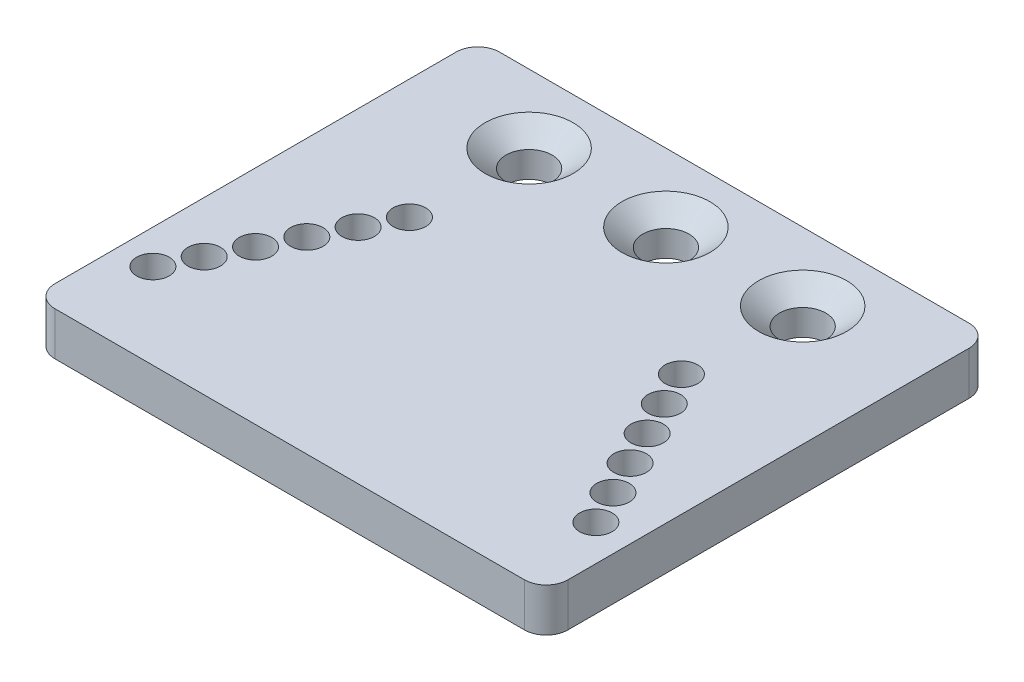
ISO-10303-21;
HEADER;
FILE_DESCRIPTION(('STEP AP214'),'2;1');
FILE_NAME('part.step','',(''),(''),'','','');
FILE_SCHEMA(('AUTOMOTIVE_DESIGN { 1 0 10303 214 1 1 1 1 }'));
ENDSEC;
DATA;
#1=APPLICATION_CONTEXT('core data for automotive mechanical design processes');
#2=APPLICATION_PROTOCOL_DEFINITION('international standard','automotive_design',2000,#1);
#3=PRODUCT_CONTEXT('',#1,'mechanical');
#4=PRODUCT('Part','Part','',(#3));
#5=PRODUCT_RELATED_PRODUCT_CATEGORY('part','',(#4));
#6=PRODUCT_DEFINITION_FORMATION('','',#4);
#7=PRODUCT_DEFINITION_CONTEXT('part definition',#1,'design');
#8=PRODUCT_DEFINITION('design','',#6,#7);
#9=PRODUCT_DEFINITION_SHAPE('','',#8);
#10=(LENGTH_UNIT() NAMED_UNIT(*) SI_UNIT(.MILLI.,.METRE.));
#11=(NAMED_UNIT(*) PLANE_ANGLE_UNIT() SI_UNIT($,.RADIAN.));
#12=(NAMED_UNIT(*) SI_UNIT($,.STERADIAN.) SOLID_ANGLE_UNIT());
#13=UNCERTAINTY_MEASURE_WITH_UNIT(LENGTH_MEASURE(1.E-05),#10,'distance_accuracy_value','');
#14=(GEOMETRIC_REPRESENTATION_CONTEXT(3) GLOBAL_UNCERTAINTY_ASSIGNED_CONTEXT((#13)) GLOBAL_UNIT_ASSIGNED_CONTEXT((#10,
#11,#12)) REPRESENTATION_CONTEXT('',''));
#15=CARTESIAN_POINT('',(0.,0.,0.));
#16=DIRECTION('',(0.,0.,1.));
#17=DIRECTION('',(1.,0.,0.));
#18=AXIS2_PLACEMENT_3D('',#15,#16,#17);
#19=CARTESIAN_POINT('',(71.825,6.35,-61.825));
#20=DIRECTION('',(0.,1.,0.));
#21=DIRECTION('',(0.,0.,1.));
#22=AXIS2_PLACEMENT_3D('',#19,#20,#21);
#23=PLANE('',#22);
#24=CARTESIAN_POINT('',(17.5,6.35,-55.));
#25=DIRECTION('',(0.,1.,0.));
#26=DIRECTION('',(0.,0.,1.));
#27=AXIS2_PLACEMENT_3D('',#24,#25,#26);
#28=CIRCLE('',#27,6.4389);
#29=CARTESIAN_POINT('',(17.5,6.35,-48.5611));
#30=VERTEX_POINT('',#29);
#31=EDGE_CURVE('E273',#30,#30,#28,.T.);
#32=ORIENTED_EDGE('',*,*,#31,.F.);
#33=EDGE_LOOP('',(#32));
#34=FACE_BOUND('',#33,.T.);
#35=CARTESIAN_POINT('',(57.5,6.35,-55.));
#36=DIRECTION('',(0.,1.,0.));
#37=DIRECTION('',(0.,0.,1.));
#38=AXIS2_PLACEMENT_3D('',#35,#36,#37);
#39=CIRCLE('',#38,6.4389);
#40=CARTESIAN_POINT('',(57.5,6.35,-48.5611));
#41=VERTEX_POINT('',#40);
#42=EDGE_CURVE('E264',#41,#41,#39,.T.);
#43=ORIENTED_EDGE('',*,*,#42,.F.);
#44=EDGE_LOOP('',(#43));
#45=FACE_BOUND('',#44,.T.);
#46=CARTESIAN_POINT('',(37.5,6.35,-55.));
#47=DIRECTION('',(0.,1.,0.));
#48=DIRECTION('',(0.,0.,1.));
#49=AXIS2_PLACEMENT_3D('',#46,#47,#48);
#50=CIRCLE('',#49,6.4389);
#51=CARTESIAN_POINT('',(37.5,6.35,-48.5611));
#52=VERTEX_POINT('',#51);
#53=EDGE_CURVE('E255',#52,#52,#50,.T.);
#54=ORIENTED_EDGE('',*,*,#53,.F.);
#55=EDGE_LOOP('',(#54));
#56=FACE_BOUND('',#55,.T.);
#57=CARTESIAN_POINT('',(57.2625,6.35,-37.5));
#58=DIRECTION('',(0.,1.,0.));
#59=DIRECTION('',(0.,0.,1.));
#60=AXIS2_PLACEMENT_3D('',#57,#58,#59);
#61=CIRCLE('',#60,2.38125);
#62=CARTESIAN_POINT('',(57.2625,6.35,-35.11875));
#63=VERTEX_POINT('',#62);
#64=EDGE_CURVE('E241',#63,#63,#61,.T.);
#65=ORIENTED_EDGE('',*,*,#64,.F.);
#66=EDGE_LOOP('',(#65));
#67=FACE_BOUND('',#66,.T.);
#68=CARTESIAN_POINT('',(15.,6.35,-32.5));
#69=DIRECTION('',(0.,1.,0.));
#70=DIRECTION('',(0.,0.,1.));
#71=AXIS2_PLACEMENT_3D('',#68,#69,#70);
#72=CIRCLE('',#71,2.38125);
#73=CARTESIAN_POINT('',(15.,6.35,-30.11875));
#74=VERTEX_POINT('',#73);
#75=EDGE_CURVE('E229',#74,#74,#72,.T.);
#76=ORIENTED_EDGE('',*,*,#75,.F.);
#77=EDGE_LOOP('',(#76));
#78=FACE_BOUND('',#77,.T.);
#79=CARTESIAN_POINT('',(62.2625,6.35,-27.5));
#80=DIRECTION('',(0.,1.,0.));
#81=DIRECTION('',(0.,0.,1.));
#82=AXIS2_PLACEMENT_3D('',#79,#80,#81);
#83=CIRCLE('',#82,2.38125000000001);
#84=CARTESIAN_POINT('',(62.2625,6.35,-25.11875));
#85=VERTEX_POINT('',#84);
#86=EDGE_CURVE('E217',#85,#85,#83,.T.);
#87=ORIENTED_EDGE('',*,*,#86,.F.);
#88=EDGE_LOOP('',(#87));
#89=FACE_BOUND('',#88,.T.);
#90=CARTESIAN_POINT('',(64.7625,6.35,-22.5));
#91=DIRECTION('',(0.,1.,0.));
#92=DIRECTION('',(0.,0.,1.));
#93=AXIS2_PLACEMENT_3D('',#90,#91,#92);
#94=CIRCLE('',#93,2.38125000000001);
#95=CARTESIAN_POINT('',(64.7625,6.35,-20.11875));
#96=VERTEX_POINT('',#95);
#97=EDGE_CURVE('E205',#96,#96,#94,.T.);
#98=ORIENTED_EDGE('',*,*,#97,.F.);
#99=EDGE_LOOP('',(#98));
#100=FACE_BOUND('',#99,.T.);
#101=CARTESIAN_POINT('',(67.2625,6.35,-17.5));
#102=DIRECTION('',(0.,1.,0.));
#103=DIRECTION('',(0.,0.,1.));
#104=AXIS2_PLACEMENT_3D('',#101,#102,#103);
#105=CIRCLE('',#104,2.38125000000001);
#106=CARTESIAN_POINT('',(67.2625,6.35,-15.11875));
#107=VERTEX_POINT('',#106);
#108=EDGE_CURVE('E193',#107,#107,#105,.T.);
#109=ORIENTED_EDGE('',*,*,#108,.F.);
#110=EDGE_LOOP('',(#109));
#111=FACE_BOUND('',#110,.T.);
#112=CARTESIAN_POINT('',(5.,6.35,-12.5));
#113=DIRECTION('',(0.,1.,0.));
#114=DIRECTION('',(0.,0.,1.));
#115=AXIS2_PLACEMENT_3D('',#112,#113,#114);
#116=CIRCLE('',#115,2.38125);
#117=CARTESIAN_POINT('',(5.,6.35,-10.11875));
#118=VERTEX_POINT('',#117);
#119=EDGE_CURVE('E181',#118,#118,#116,.T.);
#120=ORIENTED_EDGE('',*,*,#119,.F.);
#121=EDGE_LOOP('',(#120));
#122=FACE_BOUND('',#121,.T.);
#123=CARTESIAN_POINT('',(71.825,6.35,-61.825));
#124=DIRECTION('',(0.,1.,0.));
#125=DIRECTION('',(0.,0.,1.));
#126=AXIS2_PLACEMENT_3D('',#123,#124,#125);
#127=CIRCLE('',#126,3.17499999999999);
#128=CARTESIAN_POINT('',(75.,6.35,-61.825));
#129=VERTEX_POINT('',#128);
#130=CARTESIAN_POINT('',(71.825,6.35,-65.));
#131=VERTEX_POINT('',#130);
#132=EDGE_CURVE('E144',#129,#131,#127,.T.);
#133=ORIENTED_EDGE('',*,*,#132,.T.);
#134=DIRECTION('',(-1.,0.,0.));
#135=VECTOR('',#134,1.);
#136=CARTESIAN_POINT('',(3.17500000000002,6.35,-65.));
#137=LINE('',#136,#135);
#138=CARTESIAN_POINT('',(3.17500000000002,6.35,-65.));
#139=VERTEX_POINT('',#138);
#140=EDGE_CURVE('E92',#131,#139,#137,.T.);
#141=ORIENTED_EDGE('',*,*,#140,.T.);
#142=CARTESIAN_POINT('',(3.175,6.35,-61.825));
#143=DIRECTION('',(0.,1.,0.));
#144=DIRECTION('',(0.,0.,1.));
#145=AXIS2_PLACEMENT_3D('',#142,#143,#144);
#146=CIRCLE('',#145,3.175);
#147=CARTESIAN_POINT('',(0.,6.35,-61.825));
#148=VERTEX_POINT('',#147);
#149=EDGE_CURVE('E159',#139,#148,#146,.T.);
#150=ORIENTED_EDGE('',*,*,#149,.T.);
#151=DIRECTION('',(0.,0.,1.));
#152=VECTOR('',#151,1.);
#153=CARTESIAN_POINT('',(0.,6.35,-3.17500000000002));
#154=LINE('',#153,#152);
#155=CARTESIAN_POINT('',(0.,6.35,-3.17500000000002));
#156=VERTEX_POINT('',#155);
#157=EDGE_CURVE('E172',#148,#156,#154,.T.);
#158=ORIENTED_EDGE('',*,*,#157,.T.);
#159=CARTESIAN_POINT('',(3.175,6.35,-3.175));
#160=DIRECTION('',(0.,1.,0.));
#161=DIRECTION('',(0.,0.,1.));
#162=AXIS2_PLACEMENT_3D('',#159,#160,#161);
#163=CIRCLE('',#162,3.175);
#164=CARTESIAN_POINT('',(3.17500000000002,6.35,0.));
#165=VERTEX_POINT('',#164);
#166=EDGE_CURVE('E111',#156,#165,#163,.T.);
#167=ORIENTED_EDGE('',*,*,#166,.T.);
#168=DIRECTION('',(1.,0.,0.));
#169=VECTOR('',#168,1.);
#170=CARTESIAN_POINT('',(3.17500000000002,6.35,0.));
#171=LINE('',#170,#169);
#172=CARTESIAN_POINT('',(71.825,6.35,0.));
#173=VERTEX_POINT('',#172);
#174=EDGE_CURVE('E105',#165,#173,#171,.T.);
#175=ORIENTED_EDGE('',*,*,#174,.T.);
#176=CARTESIAN_POINT('',(71.825,6.35,-3.175));
#177=DIRECTION('',(0.,1.,0.));
#178=DIRECTION('',(0.,0.,-1.));
#179=AXIS2_PLACEMENT_3D('',#176,#177,#178);
#180=CIRCLE('',#179,3.175);
#181=CARTESIAN_POINT('',(75.,6.35,-3.175));
#182=VERTEX_POINT('',#181);
#183=EDGE_CURVE('E109',#173,#182,#180,.T.);
#184=ORIENTED_EDGE('',*,*,#183,.T.);
#185=DIRECTION('',(0.,0.,-1.));
#186=VECTOR('',#185,1.);
#187=CARTESIAN_POINT('',(75.,6.35,-3.175));
#188=LINE('',#187,#186);
#189=EDGE_CURVE('E49',#182,#129,#188,.T.);
#190=ORIENTED_EDGE('',*,*,#189,.T.);
#191=EDGE_LOOP('',(#133,#141,#150,#158,#167,#175,#184,#190));
#192=FACE_BOUND('',#191,.T.);
#193=CARTESIAN_POINT('',(69.7625,6.35,-12.5));
#194=DIRECTION('',(0.,1.,0.));
#195=DIRECTION('',(0.,0.,1.));
#196=AXIS2_PLACEMENT_3D('',#193,#194,#195);
#197=CIRCLE('',#196,2.38125000000001);
#198=CARTESIAN_POINT('',(69.7625,6.35,-10.11875));
#199=VERTEX_POINT('',#198);
#200=EDGE_CURVE('E133',#199,#199,#197,.T.);
#201=ORIENTED_EDGE('',*,*,#200,.F.);
#202=EDGE_LOOP('',(#201));
#203=FACE_BOUND('',#202,.T.);
#204=CARTESIAN_POINT('',(7.5,6.35,-17.5));
#205=DIRECTION('',(0.,1.,0.));
#206=DIRECTION('',(0.,0.,1.));
#207=AXIS2_PLACEMENT_3D('',#204,#205,#206);
#208=CIRCLE('',#207,2.38125);
#209=CARTESIAN_POINT('',(7.5,6.35,-15.11875));
#210=VERTEX_POINT('',#209);
#211=EDGE_CURVE('E187',#210,#210,#208,.T.);
#212=ORIENTED_EDGE('',*,*,#211,.F.);
#213=EDGE_LOOP('',(#212));
#214=FACE_BOUND('',#213,.T.);
#215=CARTESIAN_POINT('',(9.99999999999999,6.35,-22.5));
#216=DIRECTION('',(0.,1.,0.));
#217=DIRECTION('',(0.,0.,1.));
#218=AXIS2_PLACEMENT_3D('',#215,#216,#217);
#219=CIRCLE('',#218,2.38125);
#220=CARTESIAN_POINT('',(9.99999999999999,6.35,-20.11875));
#221=VERTEX_POINT('',#220);
#222=EDGE_CURVE('E199',#221,#221,#219,.T.);
#223=ORIENTED_EDGE('',*,*,#222,.F.);
#224=EDGE_LOOP('',(#223));
#225=FACE_BOUND('',#224,.T.);
#226=CARTESIAN_POINT('',(12.5,6.35,-27.5));
#227=DIRECTION('',(0.,1.,0.));
#228=DIRECTION('',(0.,0.,1.));
#229=AXIS2_PLACEMENT_3D('',#226,#227,#228);
#230=CIRCLE('',#229,2.38125);
#231=CARTESIAN_POINT('',(12.5,6.35,-25.11875));
#232=VERTEX_POINT('',#231);
#233=EDGE_CURVE('E211',#232,#232,#230,.T.);
#234=ORIENTED_EDGE('',*,*,#233,.F.);
#235=EDGE_LOOP('',(#234));
#236=FACE_BOUND('',#235,.T.);
#237=CARTESIAN_POINT('',(59.7625,6.35,-32.5));
#238=DIRECTION('',(0.,1.,0.));
#239=DIRECTION('',(0.,0.,1.));
#240=AXIS2_PLACEMENT_3D('',#237,#238,#239);
#241=CIRCLE('',#240,2.38125);
#242=CARTESIAN_POINT('',(59.7625,6.35,-30.11875));
#243=VERTEX_POINT('',#242);
#244=EDGE_CURVE('E223',#243,#243,#241,.T.);
#245=ORIENTED_EDGE('',*,*,#244,.F.);
#246=EDGE_LOOP('',(#245));
#247=FACE_BOUND('',#246,.T.);
#248=CARTESIAN_POINT('',(17.5,6.35,-37.5));
#249=DIRECTION('',(0.,1.,0.));
#250=DIRECTION('',(0.,0.,1.));
#251=AXIS2_PLACEMENT_3D('',#248,#249,#250);
#252=CIRCLE('',#251,2.38125);
#253=CARTESIAN_POINT('',(17.5,6.35,-35.11875));
#254=VERTEX_POINT('',#253);
#255=EDGE_CURVE('E235',#254,#254,#252,.T.);
#256=ORIENTED_EDGE('',*,*,#255,.F.);
#257=EDGE_LOOP('',(#256));
#258=FACE_BOUND('',#257,.T.);
#259=ADVANCED_FACE('F32',(#34,#45,#56,#67,#78,#89,#100,#111,#122,#192,#203,#214,#225,#236,#247,
#258),#23,.T.);
#260=CARTESIAN_POINT('',(71.825,0.,-61.825));
#261=DIRECTION('',(0.,1.,0.));
#262=DIRECTION('',(0.,0.,1.));
#263=AXIS2_PLACEMENT_3D('',#260,#261,#262);
#264=PLANE('',#263);
#265=CARTESIAN_POINT('',(17.5,0.,-55.));
#266=DIRECTION('',(0.,1.,0.));
#267=DIRECTION('',(0.,0.,1.));
#268=AXIS2_PLACEMENT_3D('',#265,#266,#267);
#269=CIRCLE('',#268,3.3782);
#270=CARTESIAN_POINT('',(17.5,0.,-51.6218));
#271=VERTEX_POINT('',#270);
#272=EDGE_CURVE('E267',#271,#271,#269,.T.);
#273=ORIENTED_EDGE('',*,*,#272,.T.);
#274=EDGE_LOOP('',(#273));
#275=FACE_BOUND('',#274,.T.);
#276=CARTESIAN_POINT('',(57.5,0.,-55.));
#277=DIRECTION('',(0.,1.,0.));
#278=DIRECTION('',(0.,0.,1.));
#279=AXIS2_PLACEMENT_3D('',#276,#277,#278);
#280=CIRCLE('',#279,3.3782);
#281=CARTESIAN_POINT('',(57.5,0.,-51.6218));
#282=VERTEX_POINT('',#281);
#283=EDGE_CURVE('E258',#282,#282,#280,.T.);
#284=ORIENTED_EDGE('',*,*,#283,.T.);
#285=EDGE_LOOP('',(#284));
#286=FACE_BOUND('',#285,.T.);
#287=CARTESIAN_POINT('',(37.5,0.,-55.));
#288=DIRECTION('',(0.,1.,0.));
#289=DIRECTION('',(0.,0.,1.));
#290=AXIS2_PLACEMENT_3D('',#287,#288,#289);
#291=CIRCLE('',#290,3.3782);
#292=CARTESIAN_POINT('',(37.5,0.,-51.6218));
#293=VERTEX_POINT('',#292);
#294=EDGE_CURVE('E247',#293,#293,#291,.T.);
#295=ORIENTED_EDGE('',*,*,#294,.T.);
#296=EDGE_LOOP('',(#295));
#297=FACE_BOUND('',#296,.T.);
#298=CARTESIAN_POINT('',(71.825,0.,-61.825));
#299=DIRECTION('',(0.,1.,0.));
#300=DIRECTION('',(0.,0.,1.));
#301=AXIS2_PLACEMENT_3D('',#298,#299,#300);
#302=CIRCLE('',#301,3.17499999999999);
#303=CARTESIAN_POINT('',(75.,0.,-61.825));
#304=VERTEX_POINT('',#303);
#305=CARTESIAN_POINT('',(71.825,0.,-65.));
#306=VERTEX_POINT('',#305);
#307=EDGE_CURVE('E129',#304,#306,#302,.T.);
#308=ORIENTED_EDGE('',*,*,#307,.F.);
#309=DIRECTION('',(0.,0.,-1.));
#310=VECTOR('',#309,1.);
#311=CARTESIAN_POINT('',(75.,0.,-3.175));
#312=LINE('',#311,#310);
#313=CARTESIAN_POINT('',(75.,0.,-3.175));
#314=VERTEX_POINT('',#313);
#315=EDGE_CURVE('E84',#314,#304,#312,.T.);
#316=ORIENTED_EDGE('',*,*,#315,.F.);
#317=CARTESIAN_POINT('',(71.825,0.,-3.175));
#318=DIRECTION('',(0.,1.,0.));
#319=DIRECTION('',(0.,0.,-1.));
#320=AXIS2_PLACEMENT_3D('',#317,#318,#319);
#321=CIRCLE('',#320,3.175);
#322=CARTESIAN_POINT('',(71.825,0.,0.));
#323=VERTEX_POINT('',#322);
#324=EDGE_CURVE('E78',#323,#314,#321,.T.);
#325=ORIENTED_EDGE('',*,*,#324,.F.);
#326=DIRECTION('',(1.,0.,0.));
#327=VECTOR('',#326,1.);
#328=CARTESIAN_POINT('',(3.17500000000002,0.,0.));
#329=LINE('',#328,#327);
#330=CARTESIAN_POINT('',(3.17500000000002,0.,0.));
#331=VERTEX_POINT('',#330);
#332=EDGE_CURVE('E119',#331,#323,#329,.T.);
#333=ORIENTED_EDGE('',*,*,#332,.F.);
#334=CARTESIAN_POINT('',(3.175,0.,-3.175));
#335=DIRECTION('',(0.,1.,0.));
#336=DIRECTION('',(0.,0.,1.));
#337=AXIS2_PLACEMENT_3D('',#334,#335,#336);
#338=CIRCLE('',#337,3.175);
#339=CARTESIAN_POINT('',(0.,0.,-3.17500000000002));
#340=VERTEX_POINT('',#339);
#341=EDGE_CURVE('E139',#340,#331,#338,.T.);
#342=ORIENTED_EDGE('',*,*,#341,.F.);
#343=DIRECTION('',(0.,0.,1.));
#344=VECTOR('',#343,1.);
#345=CARTESIAN_POINT('',(0.,0.,-3.17500000000002));
#346=LINE('',#345,#344);
#347=CARTESIAN_POINT('',(0.,0.,-61.825));
#348=VERTEX_POINT('',#347);
#349=EDGE_CURVE('E137',#348,#340,#346,.T.);
#350=ORIENTED_EDGE('',*,*,#349,.F.);
#351=CARTESIAN_POINT('',(3.175,0.,-61.825));
#352=DIRECTION('',(0.,1.,0.));
#353=DIRECTION('',(0.,0.,1.));
#354=AXIS2_PLACEMENT_3D('',#351,#352,#353);
#355=CIRCLE('',#354,3.175);
#356=CARTESIAN_POINT('',(3.17500000000002,0.,-65.));
#357=VERTEX_POINT('',#356);
#358=EDGE_CURVE('E135',#357,#348,#355,.T.);
#359=ORIENTED_EDGE('',*,*,#358,.F.);
#360=DIRECTION('',(-1.,0.,0.));
#361=VECTOR('',#360,1.);
#362=CARTESIAN_POINT('',(3.17500000000002,0.,-65.));
#363=LINE('',#362,#361);
#364=EDGE_CURVE('E132',#306,#357,#363,.T.);
#365=ORIENTED_EDGE('',*,*,#364,.F.);
#366=EDGE_LOOP('',(#308,#316,#325,#333,#342,#350,#359,#365));
#367=FACE_BOUND('',#366,.T.);
#368=CARTESIAN_POINT('',(69.7625,0.,-12.5));
#369=DIRECTION('',(0.,1.,0.));
#370=DIRECTION('',(0.,0.,1.));
#371=AXIS2_PLACEMENT_3D('',#368,#369,#370);
#372=CIRCLE('',#371,2.38125000000001);
#373=CARTESIAN_POINT('',(69.7625,0.,-10.11875));
#374=VERTEX_POINT('',#373);
#375=EDGE_CURVE('E178',#374,#374,#372,.T.);
#376=ORIENTED_EDGE('',*,*,#375,.T.);
#377=EDGE_LOOP('',(#376));
#378=FACE_BOUND('',#377,.T.);
#379=CARTESIAN_POINT('',(5.,0.,-12.5));
#380=DIRECTION('',(0.,1.,0.));
#381=DIRECTION('',(0.,0.,1.));
#382=AXIS2_PLACEMENT_3D('',#379,#380,#381);
#383=CIRCLE('',#382,2.38125);
#384=CARTESIAN_POINT('',(5.,0.,-10.11875));
#385=VERTEX_POINT('',#384);
#386=EDGE_CURVE('E184',#385,#385,#383,.T.);
#387=ORIENTED_EDGE('',*,*,#386,.T.);
#388=EDGE_LOOP('',(#387));
#389=FACE_BOUND('',#388,.T.);
#390=CARTESIAN_POINT('',(7.5,0.,-17.5));
#391=DIRECTION('',(0.,1.,0.));
#392=DIRECTION('',(0.,0.,1.));
#393=AXIS2_PLACEMENT_3D('',#390,#391,#392);
#394=CIRCLE('',#393,2.38125);
#395=CARTESIAN_POINT('',(7.5,0.,-15.11875));
#396=VERTEX_POINT('',#395);
#397=EDGE_CURVE('E190',#396,#396,#394,.T.);
#398=ORIENTED_EDGE('',*,*,#397,.T.);
#399=EDGE_LOOP('',(#398));
#400=FACE_BOUND('',#399,.T.);
#401=CARTESIAN_POINT('',(67.2625,0.,-17.5));
#402=DIRECTION('',(0.,1.,0.));
#403=DIRECTION('',(0.,0.,1.));
#404=AXIS2_PLACEMENT_3D('',#401,#402,#403);
#405=CIRCLE('',#404,2.38125000000001);
#406=CARTESIAN_POINT('',(67.2625,0.,-15.11875));
#407=VERTEX_POINT('',#406);
#408=EDGE_CURVE('E196',#407,#407,#405,.T.);
#409=ORIENTED_EDGE('',*,*,#408,.T.);
#410=EDGE_LOOP('',(#409));
#411=FACE_BOUND('',#410,.T.);
#412=CARTESIAN_POINT('',(9.99999999999999,0.,-22.5));
#413=DIRECTION('',(0.,1.,0.));
#414=DIRECTION('',(0.,0.,1.));
#415=AXIS2_PLACEMENT_3D('',#412,#413,#414);
#416=CIRCLE('',#415,2.38125);
#417=CARTESIAN_POINT('',(9.99999999999999,0.,-20.11875));
#418=VERTEX_POINT('',#417);
#419=EDGE_CURVE('E202',#418,#418,#416,.T.);
#420=ORIENTED_EDGE('',*,*,#419,.T.);
#421=EDGE_LOOP('',(#420));
#422=FACE_BOUND('',#421,.T.);
#423=CARTESIAN_POINT('',(64.7625,0.,-22.5));
#424=DIRECTION('',(0.,1.,0.));
#425=DIRECTION('',(0.,0.,1.));
#426=AXIS2_PLACEMENT_3D('',#423,#424,#425);
#427=CIRCLE('',#426,2.38125000000001);
#428=CARTESIAN_POINT('',(64.7625,0.,-20.11875));
#429=VERTEX_POINT('',#428);
#430=EDGE_CURVE('E208',#429,#429,#427,.T.);
#431=ORIENTED_EDGE('',*,*,#430,.T.);
#432=EDGE_LOOP('',(#431));
#433=FACE_BOUND('',#432,.T.);
#434=CARTESIAN_POINT('',(12.5,0.,-27.5));
#435=DIRECTION('',(0.,1.,0.));
#436=DIRECTION('',(0.,0.,1.));
#437=AXIS2_PLACEMENT_3D('',#434,#435,#436);
#438=CIRCLE('',#437,2.38125);
#439=CARTESIAN_POINT('',(12.5,0.,-25.11875));
#440=VERTEX_POINT('',#439);
#441=EDGE_CURVE('E214',#440,#440,#438,.T.);
#442=ORIENTED_EDGE('',*,*,#441,.T.);
#443=EDGE_LOOP('',(#442));
#444=FACE_BOUND('',#443,.T.);
#445=CARTESIAN_POINT('',(62.2625,0.,-27.5));
#446=DIRECTION('',(0.,1.,0.));
#447=DIRECTION('',(0.,0.,1.));
#448=AXIS2_PLACEMENT_3D('',#445,#446,#447);
#449=CIRCLE('',#448,2.38125000000001);
#450=CARTESIAN_POINT('',(62.2625,0.,-25.11875));
#451=VERTEX_POINT('',#450);
#452=EDGE_CURVE('E220',#451,#451,#449,.T.);
#453=ORIENTED_EDGE('',*,*,#452,.T.);
#454=EDGE_LOOP('',(#453));
#455=FACE_BOUND('',#454,.T.);
#456=CARTESIAN_POINT('',(59.7625,0.,-32.5));
#457=DIRECTION('',(0.,1.,0.));
#458=DIRECTION('',(0.,0.,1.));
#459=AXIS2_PLACEMENT_3D('',#456,#457,#458);
#460=CIRCLE('',#459,2.38125);
#461=CARTESIAN_POINT('',(59.7625,0.,-30.11875));
#462=VERTEX_POINT('',#461);
#463=EDGE_CURVE('E226',#462,#462,#460,.T.);
#464=ORIENTED_EDGE('',*,*,#463,.T.);
#465=EDGE_LOOP('',(#464));
#466=FACE_BOUND('',#465,.T.);
#467=CARTESIAN_POINT('',(15.,0.,-32.5));
#468=DIRECTION('',(0.,1.,0.));
#469=DIRECTION('',(0.,0.,1.));
#470=AXIS2_PLACEMENT_3D('',#467,#468,#469);
#471=CIRCLE('',#470,2.38125);
#472=CARTESIAN_POINT('',(15.,0.,-30.11875));
#473=VERTEX_POINT('',#472);
#474=EDGE_CURVE('E232',#473,#473,#471,.T.);
#475=ORIENTED_EDGE('',*,*,#474,.T.);
#476=EDGE_LOOP('',(#475));
#477=FACE_BOUND('',#476,.T.);
#478=CARTESIAN_POINT('',(17.5,0.,-37.5));
#479=DIRECTION('',(0.,1.,0.));
#480=DIRECTION('',(0.,0.,1.));
#481=AXIS2_PLACEMENT_3D('',#478,#479,#480);
#482=CIRCLE('',#481,2.38125);
#483=CARTESIAN_POINT('',(17.5,0.,-35.11875));
#484=VERTEX_POINT('',#483);
#485=EDGE_CURVE('E238',#484,#484,#482,.T.);
#486=ORIENTED_EDGE('',*,*,#485,.T.);
#487=EDGE_LOOP('',(#486));
#488=FACE_BOUND('',#487,.T.);
#489=CARTESIAN_POINT('',(57.2625,0.,-37.5));
#490=DIRECTION('',(0.,1.,0.));
#491=DIRECTION('',(0.,0.,1.));
#492=AXIS2_PLACEMENT_3D('',#489,#490,#491);
#493=CIRCLE('',#492,2.38125);
#494=CARTESIAN_POINT('',(57.2625,0.,-35.11875));
#495=VERTEX_POINT('',#494);
#496=EDGE_CURVE('E244',#495,#495,#493,.T.);
#497=ORIENTED_EDGE('',*,*,#496,.T.);
#498=EDGE_LOOP('',(#497));
#499=FACE_BOUND('',#498,.T.);
#500=ADVANCED_FACE('F163',(#275,#286,#297,#367,#378,#389,#400,#411,#422,#433,#444,#455,#466,
#477,#488,#499),#264,.F.);
#501=CARTESIAN_POINT('',(71.825,6.35,-61.825));
#502=DIRECTION('',(0.,-1.,0.));
#503=DIRECTION('',(0.,0.,-1.));
#504=AXIS2_PLACEMENT_3D('',#501,#502,#503);
#505=CYLINDRICAL_SURFACE('',#504,3.17499999999999);
#506=ORIENTED_EDGE('',*,*,#307,.T.);
#507=DIRECTION('',(0.,-1.,0.));
#508=VECTOR('',#507,1.);
#509=CARTESIAN_POINT('',(71.825,6.35,-65.));
#510=LINE('',#509,#508);
#511=EDGE_CURVE('E11',#131,#306,#510,.T.);
#512=ORIENTED_EDGE('',*,*,#511,.F.);
#513=ORIENTED_EDGE('',*,*,#132,.F.);
#514=DIRECTION('',(0.,-1.,0.));
#515=VECTOR('',#514,1.);
#516=CARTESIAN_POINT('',(75.,6.35,-61.825));
#517=LINE('',#516,#515);
#518=EDGE_CURVE('E125',#129,#304,#517,.T.);
#519=ORIENTED_EDGE('',*,*,#518,.T.);
#520=EDGE_LOOP('',(#506,#512,#513,#519));
#521=FACE_BOUND('',#520,.T.);
#522=ADVANCED_FACE('F34',(#521),#505,.T.);
#523=CARTESIAN_POINT('',(3.17500000000002,6.35,-65.));
#524=DIRECTION('',(0.,0.,1.));
#525=DIRECTION('',(1.,0.,0.));
#526=AXIS2_PLACEMENT_3D('',#523,#524,#525);
#527=PLANE('',#526);
#528=ORIENTED_EDGE('',*,*,#364,.T.);
#529=DIRECTION('',(0.,-1.,0.));
#530=VECTOR('',#529,1.);
#531=CARTESIAN_POINT('',(3.17500000000002,6.35,-65.));
#532=LINE('',#531,#530);
#533=EDGE_CURVE('E41',#139,#357,#532,.T.);
#534=ORIENTED_EDGE('',*,*,#533,.F.);
#535=ORIENTED_EDGE('',*,*,#140,.F.);
#536=ORIENTED_EDGE('',*,*,#511,.T.);
#537=EDGE_LOOP('',(#528,#534,#535,#536));
#538=FACE_BOUND('',#537,.T.);
#539=ADVANCED_FACE('F393',(#538),#527,.F.);
#540=CARTESIAN_POINT('',(3.175,6.35,-61.825));
#541=DIRECTION('',(0.,-1.,0.));
#542=DIRECTION('',(0.,0.,-1.));
#543=AXIS2_PLACEMENT_3D('',#540,#541,#542);
#544=CYLINDRICAL_SURFACE('',#543,3.175);
#545=ORIENTED_EDGE('',*,*,#358,.T.);
#546=DIRECTION('',(0.,-1.,0.));
#547=VECTOR('',#546,1.);
#548=CARTESIAN_POINT('',(0.,6.35,-61.825));
#549=LINE('',#548,#547);
#550=EDGE_CURVE('E151',#148,#348,#549,.T.);
#551=ORIENTED_EDGE('',*,*,#550,.F.);
#552=ORIENTED_EDGE('',*,*,#149,.F.);
#553=ORIENTED_EDGE('',*,*,#533,.T.);
#554=EDGE_LOOP('',(#545,#551,#552,#553));
#555=FACE_BOUND('',#554,.T.);
#556=ADVANCED_FACE('F157',(#555),#544,.T.);
#557=CARTESIAN_POINT('',(0.,6.35,-3.17500000000002));
#558=DIRECTION('',(1.,0.,0.));
#559=DIRECTION('',(0.,0.,-1.));
#560=AXIS2_PLACEMENT_3D('',#557,#558,#559);
#561=PLANE('',#560);
#562=ORIENTED_EDGE('',*,*,#349,.T.);
#563=DIRECTION('',(0.,-1.,0.));
#564=VECTOR('',#563,1.);
#565=CARTESIAN_POINT('',(0.,6.35,-3.17500000000002));
#566=LINE('',#565,#564);
#567=EDGE_CURVE('E148',#156,#340,#566,.T.);
#568=ORIENTED_EDGE('',*,*,#567,.F.);
#569=ORIENTED_EDGE('',*,*,#157,.F.);
#570=ORIENTED_EDGE('',*,*,#550,.T.);
#571=EDGE_LOOP('',(#562,#568,#569,#570));
#572=FACE_BOUND('',#571,.T.);
#573=ADVANCED_FACE('F168',(#572),#561,.F.);
#574=CARTESIAN_POINT('',(3.175,6.35,-3.175));
#575=DIRECTION('',(0.,-1.,0.));
#576=DIRECTION('',(0.,0.,-1.));
#577=AXIS2_PLACEMENT_3D('',#574,#575,#576);
#578=CYLINDRICAL_SURFACE('',#577,3.175);
#579=ORIENTED_EDGE('',*,*,#341,.T.);
#580=DIRECTION('',(0.,-1.,0.));
#581=VECTOR('',#580,1.);
#582=CARTESIAN_POINT('',(3.17500000000002,6.35,0.));
#583=LINE('',#582,#581);
#584=EDGE_CURVE('E120',#165,#331,#583,.T.);
#585=ORIENTED_EDGE('',*,*,#584,.F.);
#586=ORIENTED_EDGE('',*,*,#166,.F.);
#587=ORIENTED_EDGE('',*,*,#567,.T.);
#588=EDGE_LOOP('',(#579,#585,#586,#587));
#589=FACE_BOUND('',#588,.T.);
#590=ADVANCED_FACE('F171',(#589),#578,.T.);
#591=CARTESIAN_POINT('',(3.17500000000002,6.35,0.));
#592=DIRECTION('',(0.,0.,-1.));
#593=DIRECTION('',(-1.,0.,0.));
#594=AXIS2_PLACEMENT_3D('',#591,#592,#593);
#595=PLANE('',#594);
#596=ORIENTED_EDGE('',*,*,#332,.T.);
#597=DIRECTION('',(0.,-1.,0.));
#598=VECTOR('',#597,1.);
#599=CARTESIAN_POINT('',(71.825,6.35,0.));
#600=LINE('',#599,#598);
#601=EDGE_CURVE('E116',#173,#323,#600,.T.);
#602=ORIENTED_EDGE('',*,*,#601,.F.);
#603=ORIENTED_EDGE('',*,*,#174,.F.);
#604=ORIENTED_EDGE('',*,*,#584,.T.);
#605=EDGE_LOOP('',(#596,#602,#603,#604));
#606=FACE_BOUND('',#605,.T.);
#607=ADVANCED_FACE('F117',(#606),#595,.F.);
#608=CARTESIAN_POINT('',(71.825,6.35,-3.175));
#609=DIRECTION('',(0.,-1.,0.));
#610=DIRECTION('',(0.,0.,-1.));
#611=AXIS2_PLACEMENT_3D('',#608,#609,#610);
#612=CYLINDRICAL_SURFACE('',#611,3.175);
#613=ORIENTED_EDGE('',*,*,#324,.T.);
#614=DIRECTION('',(0.,-1.,0.));
#615=VECTOR('',#614,1.);
#616=CARTESIAN_POINT('',(75.,6.35,-3.175));
#617=LINE('',#616,#615);
#618=EDGE_CURVE('E121',#182,#314,#617,.T.);
#619=ORIENTED_EDGE('',*,*,#618,.F.);
#620=ORIENTED_EDGE('',*,*,#183,.F.);
#621=ORIENTED_EDGE('',*,*,#601,.T.);
#622=EDGE_LOOP('',(#613,#619,#620,#621));
#623=FACE_BOUND('',#622,.T.);
#624=ADVANCED_FACE('F123',(#623),#612,.T.);
#625=CARTESIAN_POINT('',(75.,6.35,-3.175));
#626=DIRECTION('',(-1.,0.,0.));
#627=DIRECTION('',(0.,0.,1.));
#628=AXIS2_PLACEMENT_3D('',#625,#626,#627);
#629=PLANE('',#628);
#630=ORIENTED_EDGE('',*,*,#315,.T.);
#631=ORIENTED_EDGE('',*,*,#518,.F.);
#632=ORIENTED_EDGE('',*,*,#189,.F.);
#633=ORIENTED_EDGE('',*,*,#618,.T.);
#634=EDGE_LOOP('',(#630,#631,#632,#633));
#635=FACE_BOUND('',#634,.T.);
#636=ADVANCED_FACE('F379',(#635),#629,.F.);
#637=CARTESIAN_POINT('',(69.7625,6.35,-12.5));
#638=DIRECTION('',(0.,-1.,0.));
#639=DIRECTION('',(0.,0.,-1.));
#640=AXIS2_PLACEMENT_3D('',#637,#638,#639);
#641=CYLINDRICAL_SURFACE('',#640,2.38125000000001);
#642=ORIENTED_EDGE('',*,*,#200,.T.);
#643=EDGE_LOOP('',(#642));
#644=FACE_BOUND('',#643,.T.);
#645=ORIENTED_EDGE('',*,*,#375,.F.);
#646=EDGE_LOOP('',(#645));
#647=FACE_BOUND('',#646,.T.);
#648=ADVANCED_FACE('F302',(#644,#647),#641,.F.);
#649=CARTESIAN_POINT('',(5.,6.35,-12.5));
#650=DIRECTION('',(0.,-1.,0.));
#651=DIRECTION('',(0.,0.,-1.));
#652=AXIS2_PLACEMENT_3D('',#649,#650,#651);
#653=CYLINDRICAL_SURFACE('',#652,2.38125);
#654=ORIENTED_EDGE('',*,*,#119,.T.);
#655=EDGE_LOOP('',(#654));
#656=FACE_BOUND('',#655,.T.);
#657=ORIENTED_EDGE('',*,*,#386,.F.);
#658=EDGE_LOOP('',(#657));
#659=FACE_BOUND('',#658,.T.);
#660=ADVANCED_FACE('F298',(#656,#659),#653,.F.);
#661=CARTESIAN_POINT('',(7.5,6.35,-17.5));
#662=DIRECTION('',(0.,-1.,0.));
#663=DIRECTION('',(0.,0.,-1.));
#664=AXIS2_PLACEMENT_3D('',#661,#662,#663);
#665=CYLINDRICAL_SURFACE('',#664,2.38125);
#666=ORIENTED_EDGE('',*,*,#211,.T.);
#667=EDGE_LOOP('',(#666));
#668=FACE_BOUND('',#667,.T.);
#669=ORIENTED_EDGE('',*,*,#397,.F.);
#670=EDGE_LOOP('',(#669));
#671=FACE_BOUND('',#670,.T.);
#672=ADVANCED_FACE('F301',(#668,#671),#665,.F.);
#673=CARTESIAN_POINT('',(67.2625,6.35,-17.5));
#674=DIRECTION('',(0.,-1.,0.));
#675=DIRECTION('',(0.,0.,-1.));
#676=AXIS2_PLACEMENT_3D('',#673,#674,#675);
#677=CYLINDRICAL_SURFACE('',#676,2.38125000000001);
#678=ORIENTED_EDGE('',*,*,#108,.T.);
#679=EDGE_LOOP('',(#678));
#680=FACE_BOUND('',#679,.T.);
#681=ORIENTED_EDGE('',*,*,#408,.F.);
#682=EDGE_LOOP('',(#681));
#683=FACE_BOUND('',#682,.T.);
#684=ADVANCED_FACE('F370',(#680,#683),#677,.F.);
#685=CARTESIAN_POINT('',(9.99999999999999,6.35,-22.5));
#686=DIRECTION('',(0.,-1.,0.));
#687=DIRECTION('',(0.,0.,-1.));
#688=AXIS2_PLACEMENT_3D('',#685,#686,#687);
#689=CYLINDRICAL_SURFACE('',#688,2.38125);
#690=ORIENTED_EDGE('',*,*,#222,.T.);
#691=EDGE_LOOP('',(#690));
#692=FACE_BOUND('',#691,.T.);
#693=ORIENTED_EDGE('',*,*,#419,.F.);
#694=EDGE_LOOP('',(#693));
#695=FACE_BOUND('',#694,.T.);
#696=ADVANCED_FACE('F366',(#692,#695),#689,.F.);
#697=CARTESIAN_POINT('',(64.7625,6.35,-22.5));
#698=DIRECTION('',(0.,-1.,0.));
#699=DIRECTION('',(0.,0.,-1.));
#700=AXIS2_PLACEMENT_3D('',#697,#698,#699);
#701=CYLINDRICAL_SURFACE('',#700,2.38125000000001);
#702=ORIENTED_EDGE('',*,*,#97,.T.);
#703=EDGE_LOOP('',(#702));
#704=FACE_BOUND('',#703,.T.);
#705=ORIENTED_EDGE('',*,*,#430,.F.);
#706=EDGE_LOOP('',(#705));
#707=FACE_BOUND('',#706,.T.);
#708=ADVANCED_FACE('F362',(#704,#707),#701,.F.);
#709=CARTESIAN_POINT('',(12.5,6.35,-27.5));
#710=DIRECTION('',(0.,-1.,0.));
#711=DIRECTION('',(0.,0.,-1.));
#712=AXIS2_PLACEMENT_3D('',#709,#710,#711);
#713=CYLINDRICAL_SURFACE('',#712,2.38125);
#714=ORIENTED_EDGE('',*,*,#233,.T.);
#715=EDGE_LOOP('',(#714));
#716=FACE_BOUND('',#715,.T.);
#717=ORIENTED_EDGE('',*,*,#441,.F.);
#718=EDGE_LOOP('',(#717));
#719=FACE_BOUND('',#718,.T.);
#720=ADVANCED_FACE('F358',(#716,#719),#713,.F.);
#721=CARTESIAN_POINT('',(62.2625,6.35,-27.5));
#722=DIRECTION('',(0.,-1.,0.));
#723=DIRECTION('',(0.,0.,-1.));
#724=AXIS2_PLACEMENT_3D('',#721,#722,#723);
#725=CYLINDRICAL_SURFACE('',#724,2.38125000000001);
#726=ORIENTED_EDGE('',*,*,#86,.T.);
#727=EDGE_LOOP('',(#726));
#728=FACE_BOUND('',#727,.T.);
#729=ORIENTED_EDGE('',*,*,#452,.F.);
#730=EDGE_LOOP('',(#729));
#731=FACE_BOUND('',#730,.T.);
#732=ADVANCED_FACE('F354',(#728,#731),#725,.F.);
#733=CARTESIAN_POINT('',(59.7625,6.35,-32.5));
#734=DIRECTION('',(0.,-1.,0.));
#735=DIRECTION('',(0.,0.,-1.));
#736=AXIS2_PLACEMENT_3D('',#733,#734,#735);
#737=CYLINDRICAL_SURFACE('',#736,2.38125);
#738=ORIENTED_EDGE('',*,*,#244,.T.);
#739=EDGE_LOOP('',(#738));
#740=FACE_BOUND('',#739,.T.);
#741=ORIENTED_EDGE('',*,*,#463,.F.);
#742=EDGE_LOOP('',(#741));
#743=FACE_BOUND('',#742,.T.);
#744=ADVANCED_FACE('F350',(#740,#743),#737,.F.);
#745=CARTESIAN_POINT('',(15.,6.35,-32.5));
#746=DIRECTION('',(0.,-1.,0.));
#747=DIRECTION('',(0.,0.,-1.));
#748=AXIS2_PLACEMENT_3D('',#745,#746,#747);
#749=CYLINDRICAL_SURFACE('',#748,2.38125);
#750=ORIENTED_EDGE('',*,*,#75,.T.);
#751=EDGE_LOOP('',(#750));
#752=FACE_BOUND('',#751,.T.);
#753=ORIENTED_EDGE('',*,*,#474,.F.);
#754=EDGE_LOOP('',(#753));
#755=FACE_BOUND('',#754,.T.);
#756=ADVANCED_FACE('F343',(#752,#755),#749,.F.);
#757=CARTESIAN_POINT('',(17.5,6.35,-37.5));
#758=DIRECTION('',(0.,-1.,0.));
#759=DIRECTION('',(0.,0.,-1.));
#760=AXIS2_PLACEMENT_3D('',#757,#758,#759);
#761=CYLINDRICAL_SURFACE('',#760,2.38125);
#762=ORIENTED_EDGE('',*,*,#255,.T.);
#763=EDGE_LOOP('',(#762));
#764=FACE_BOUND('',#763,.T.);
#765=ORIENTED_EDGE('',*,*,#485,.F.);
#766=EDGE_LOOP('',(#765));
#767=FACE_BOUND('',#766,.T.);
#768=ADVANCED_FACE('F333',(#764,#767),#761,.F.);
#769=CARTESIAN_POINT('',(57.2625,6.35,-37.5));
#770=DIRECTION('',(0.,-1.,0.));
#771=DIRECTION('',(0.,0.,-1.));
#772=AXIS2_PLACEMENT_3D('',#769,#770,#771);
#773=CYLINDRICAL_SURFACE('',#772,2.38125);
#774=ORIENTED_EDGE('',*,*,#64,.T.);
#775=EDGE_LOOP('',(#774));
#776=FACE_BOUND('',#775,.T.);
#777=ORIENTED_EDGE('',*,*,#496,.F.);
#778=EDGE_LOOP('',(#777));
#779=FACE_BOUND('',#778,.T.);
#780=ADVANCED_FACE('F330',(#776,#779),#773,.F.);
#781=CARTESIAN_POINT('',(37.5,6.35,-55.));
#782=DIRECTION('',(0.,1.,0.));
#783=DIRECTION('',(0.,0.,1.));
#784=AXIS2_PLACEMENT_3D('',#781,#782,#783);
#785=CYLINDRICAL_SURFACE('',#784,3.3782);
#786=ORIENTED_EDGE('',*,*,#294,.F.);
#787=EDGE_LOOP('',(#786));
#788=FACE_BOUND('',#787,.T.);
#789=CARTESIAN_POINT('',(37.5,3.7817677588557,-55.));
#790=DIRECTION('',(0.,1.,0.));
#791=DIRECTION('',(0.,0.,1.));
#792=AXIS2_PLACEMENT_3D('',#789,#790,#791);
#793=CIRCLE('',#792,3.3782);
#794=CARTESIAN_POINT('',(37.5,3.7817677588557,-51.6218));
#795=VERTEX_POINT('',#794);
#796=EDGE_CURVE('E252',#795,#795,#793,.T.);
#797=ORIENTED_EDGE('',*,*,#796,.T.);
#798=EDGE_LOOP('',(#797));
#799=FACE_BOUND('',#798,.T.);
#800=ADVANCED_FACE('F332',(#788,#799),#785,.F.);
#801=CARTESIAN_POINT('',(37.5,6.35,-55.));
#802=DIRECTION('',(0.,1.,0.));
#803=DIRECTION('',(0.,0.,1.));
#804=AXIS2_PLACEMENT_3D('',#801,#802,#803);
#805=CONICAL_SURFACE('',#804,6.4389,0.872664625997165);
#806=ORIENTED_EDGE('',*,*,#796,.F.);
#807=EDGE_LOOP('',(#806));
#808=FACE_BOUND('',#807,.T.);
#809=ORIENTED_EDGE('',*,*,#53,.T.);
#810=EDGE_LOOP('',(#809));
#811=FACE_BOUND('',#810,.T.);
#812=ADVANCED_FACE('F340',(#808,#811),#805,.F.);
#813=CARTESIAN_POINT('',(57.5,6.35,-55.));
#814=DIRECTION('',(0.,1.,0.));
#815=DIRECTION('',(0.,0.,1.));
#816=AXIS2_PLACEMENT_3D('',#813,#814,#815);
#817=CYLINDRICAL_SURFACE('',#816,3.3782);
#818=ORIENTED_EDGE('',*,*,#283,.F.);
#819=EDGE_LOOP('',(#818));
#820=FACE_BOUND('',#819,.T.);
#821=CARTESIAN_POINT('',(57.5,3.7817677588557,-55.));
#822=DIRECTION('',(0.,1.,0.));
#823=DIRECTION('',(0.,0.,1.));
#824=AXIS2_PLACEMENT_3D('',#821,#822,#823);
#825=CIRCLE('',#824,3.3782);
#826=CARTESIAN_POINT('',(57.5,3.7817677588557,-51.6218));
#827=VERTEX_POINT('',#826);
#828=EDGE_CURVE('E261',#827,#827,#825,.T.);
#829=ORIENTED_EDGE('',*,*,#828,.T.);
#830=EDGE_LOOP('',(#829));
#831=FACE_BOUND('',#830,.T.);
#832=ADVANCED_FACE('F540',(#820,#831),#817,.F.);
#833=CARTESIAN_POINT('',(57.5,6.35,-55.));
#834=DIRECTION('',(0.,1.,0.));
#835=DIRECTION('',(0.,0.,1.));
#836=AXIS2_PLACEMENT_3D('',#833,#834,#835);
#837=CONICAL_SURFACE('',#836,6.4389,0.872664625997165);
#838=ORIENTED_EDGE('',*,*,#828,.F.);
#839=EDGE_LOOP('',(#838));
#840=FACE_BOUND('',#839,.T.);
#841=ORIENTED_EDGE('',*,*,#42,.T.);
#842=EDGE_LOOP('',(#841));
#843=FACE_BOUND('',#842,.T.);
#844=ADVANCED_FACE('F548',(#840,#843),#837,.F.);
#845=CARTESIAN_POINT('',(17.5,6.35,-55.));
#846=DIRECTION('',(0.,1.,0.));
#847=DIRECTION('',(0.,0.,1.));
#848=AXIS2_PLACEMENT_3D('',#845,#846,#847);
#849=CYLINDRICAL_SURFACE('',#848,3.3782);
#850=ORIENTED_EDGE('',*,*,#272,.F.);
#851=EDGE_LOOP('',(#850));
#852=FACE_BOUND('',#851,.T.);
#853=CARTESIAN_POINT('',(17.5,3.7817677588557,-55.));
#854=DIRECTION('',(0.,1.,0.));
#855=DIRECTION('',(0.,0.,1.));
#856=AXIS2_PLACEMENT_3D('',#853,#854,#855);
#857=CIRCLE('',#856,3.3782);
#858=CARTESIAN_POINT('',(17.5,3.7817677588557,-51.6218));
#859=VERTEX_POINT('',#858);
#860=EDGE_CURVE('E270',#859,#859,#857,.T.);
#861=ORIENTED_EDGE('',*,*,#860,.T.);
#862=EDGE_LOOP('',(#861));
#863=FACE_BOUND('',#862,.T.);
#864=ADVANCED_FACE('F557',(#852,#863),#849,.F.);
#865=CARTESIAN_POINT('',(17.5,6.35,-55.));
#866=DIRECTION('',(0.,1.,0.));
#867=DIRECTION('',(0.,0.,1.));
#868=AXIS2_PLACEMENT_3D('',#865,#866,#867);
#869=CONICAL_SURFACE('',#868,6.4389,0.872664625997165);
#870=ORIENTED_EDGE('',*,*,#860,.F.);
#871=EDGE_LOOP('',(#870));
#872=FACE_BOUND('',#871,.T.);
#873=ORIENTED_EDGE('',*,*,#31,.T.);
#874=EDGE_LOOP('',(#873));
#875=FACE_BOUND('',#874,.T.);
#876=ADVANCED_FACE('F277',(#872,#875),#869,.F.);
#877=CLOSED_SHELL('',(#259,#500,#522,#539,#556,#573,#590,#607,#624,#636,#648,#660,#672,#684,
#696,#708,#720,#732,#744,#756,#768,#780,#800,#812,#832,#844,#864,#876));
#878=MANIFOLD_SOLID_BREP('B2',#877);
#879=ADVANCED_BREP_SHAPE_REPRESENTATION('',(#18,#878),#14);
#880=SHAPE_DEFINITION_REPRESENTATION(#9,#879);
ENDSEC;
END-ISO-10303-21;
